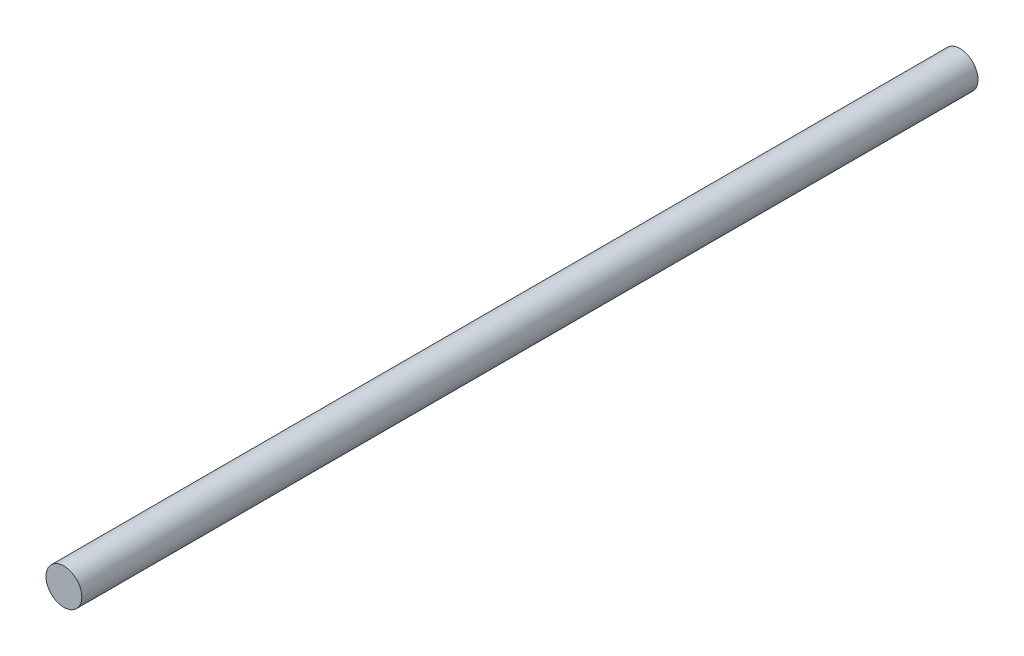
ISO-10303-21;
HEADER;
FILE_DESCRIPTION(('STEP AP214'),'2;1');
FILE_NAME('part.step','',(''),(''),'','','');
FILE_SCHEMA(('AUTOMOTIVE_DESIGN { 1 0 10303 214 1 1 1 1 }'));
ENDSEC;
DATA;
#1=APPLICATION_CONTEXT('core data for automotive mechanical design processes');
#2=APPLICATION_PROTOCOL_DEFINITION('international standard','automotive_design',2000,#1);
#3=PRODUCT_CONTEXT('',#1,'mechanical');
#4=PRODUCT('Part','Part','',(#3));
#5=PRODUCT_RELATED_PRODUCT_CATEGORY('part','',(#4));
#6=PRODUCT_DEFINITION_FORMATION('','',#4);
#7=PRODUCT_DEFINITION_CONTEXT('part definition',#1,'design');
#8=PRODUCT_DEFINITION('design','',#6,#7);
#9=PRODUCT_DEFINITION_SHAPE('','',#8);
#10=(LENGTH_UNIT() NAMED_UNIT(*) SI_UNIT(.MILLI.,.METRE.));
#11=(NAMED_UNIT(*) PLANE_ANGLE_UNIT() SI_UNIT($,.RADIAN.));
#12=(NAMED_UNIT(*) SI_UNIT($,.STERADIAN.) SOLID_ANGLE_UNIT());
#13=UNCERTAINTY_MEASURE_WITH_UNIT(LENGTH_MEASURE(1.E-05),#10,'distance_accuracy_value','');
#14=(GEOMETRIC_REPRESENTATION_CONTEXT(3) GLOBAL_UNCERTAINTY_ASSIGNED_CONTEXT((#13)) GLOBAL_UNIT_ASSIGNED_CONTEXT((#10,
#11,#12)) REPRESENTATION_CONTEXT('',''));
#15=CARTESIAN_POINT('',(0.,0.,0.));
#16=DIRECTION('',(0.,0.,1.));
#17=DIRECTION('',(1.,0.,0.));
#18=AXIS2_PLACEMENT_3D('',#15,#16,#17);
#19=CARTESIAN_POINT('',(0.,0.,300.));
#20=DIRECTION('',(0.,0.,-1.));
#21=DIRECTION('',(-1.,0.,0.));
#22=AXIS2_PLACEMENT_3D('',#19,#20,#21);
#23=CYLINDRICAL_SURFACE('',#22,6.);
#24=CARTESIAN_POINT('',(0.,0.,300.));
#25=DIRECTION('',(0.,0.,1.));
#26=DIRECTION('',(1.,0.,0.));
#27=AXIS2_PLACEMENT_3D('',#24,#25,#26);
#28=CIRCLE('',#27,6.);
#29=CARTESIAN_POINT('',(6.,0.,300.));
#30=VERTEX_POINT('',#29);
#31=EDGE_CURVE('E10',#30,#30,#28,.T.);
#32=ORIENTED_EDGE('',*,*,#31,.F.);
#33=EDGE_LOOP('',(#32));
#34=FACE_BOUND('',#33,.T.);
#35=CARTESIAN_POINT('',(0.,0.,0.));
#36=DIRECTION('',(0.,0.,1.));
#37=DIRECTION('',(1.,0.,0.));
#38=AXIS2_PLACEMENT_3D('',#35,#36,#37);
#39=CIRCLE('',#38,6.);
#40=CARTESIAN_POINT('',(6.,0.,0.));
#41=VERTEX_POINT('',#40);
#42=EDGE_CURVE('E40',#41,#41,#39,.T.);
#43=ORIENTED_EDGE('',*,*,#42,.T.);
#44=EDGE_LOOP('',(#43));
#45=FACE_BOUND('',#44,.T.);
#46=ADVANCED_FACE('F37',(#34,#45),#23,.T.);
#47=CARTESIAN_POINT('',(0.,0.,300.));
#48=DIRECTION('',(0.,0.,1.));
#49=DIRECTION('',(1.,0.,0.));
#50=AXIS2_PLACEMENT_3D('',#47,#48,#49);
#51=PLANE('',#50);
#52=ORIENTED_EDGE('',*,*,#31,.T.);
#53=EDGE_LOOP('',(#52));
#54=FACE_BOUND('',#53,.T.);
#55=ADVANCED_FACE('F54',(#54),#51,.T.);
#56=CARTESIAN_POINT('',(0.,0.,0.));
#57=DIRECTION('',(0.,0.,1.));
#58=DIRECTION('',(1.,0.,0.));
#59=AXIS2_PLACEMENT_3D('',#56,#57,#58);
#60=PLANE('',#59);
#61=ORIENTED_EDGE('',*,*,#42,.F.);
#62=EDGE_LOOP('',(#61));
#63=FACE_BOUND('',#62,.T.);
#64=ADVANCED_FACE('F52',(#63),#60,.F.);
#65=CLOSED_SHELL('',(#46,#55,#64));
#66=MANIFOLD_SOLID_BREP('B2',#65);
#67=ADVANCED_BREP_SHAPE_REPRESENTATION('',(#18,#66),#14);
#68=SHAPE_DEFINITION_REPRESENTATION(#9,#67);
ENDSEC;
END-ISO-10303-21;
